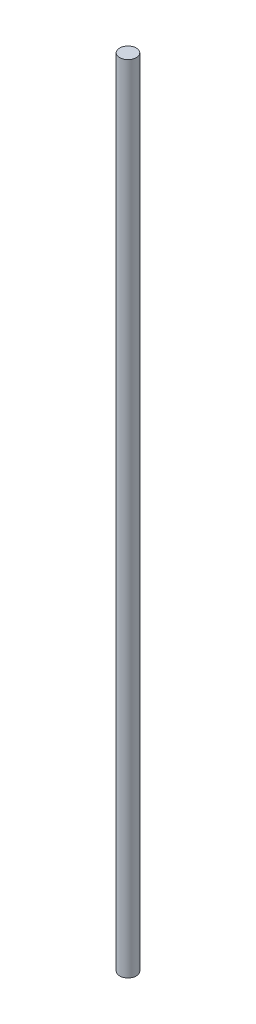
ISO-10303-21;
HEADER;
FILE_DESCRIPTION(('STEP AP214'),'2;1');
FILE_NAME('part.step','',(''),(''),'','','');
FILE_SCHEMA(('AUTOMOTIVE_DESIGN { 1 0 10303 214 1 1 1 1 }'));
ENDSEC;
DATA;
#1=APPLICATION_CONTEXT('core data for automotive mechanical design processes');
#2=APPLICATION_PROTOCOL_DEFINITION('international standard','automotive_design',2000,#1);
#3=PRODUCT_CONTEXT('',#1,'mechanical');
#4=PRODUCT('Part','Part','',(#3));
#5=PRODUCT_RELATED_PRODUCT_CATEGORY('part','',(#4));
#6=PRODUCT_DEFINITION_FORMATION('','',#4);
#7=PRODUCT_DEFINITION_CONTEXT('part definition',#1,'design');
#8=PRODUCT_DEFINITION('design','',#6,#7);
#9=PRODUCT_DEFINITION_SHAPE('','',#8);
#10=(LENGTH_UNIT() NAMED_UNIT(*) SI_UNIT(.MILLI.,.METRE.));
#11=(NAMED_UNIT(*) PLANE_ANGLE_UNIT() SI_UNIT($,.RADIAN.));
#12=(NAMED_UNIT(*) SI_UNIT($,.STERADIAN.) SOLID_ANGLE_UNIT());
#13=UNCERTAINTY_MEASURE_WITH_UNIT(LENGTH_MEASURE(1.E-05),#10,'distance_accuracy_value','');
#14=(GEOMETRIC_REPRESENTATION_CONTEXT(3) GLOBAL_UNCERTAINTY_ASSIGNED_CONTEXT((#13)) GLOBAL_UNIT_ASSIGNED_CONTEXT((#10,
#11,#12)) REPRESENTATION_CONTEXT('',''));
#15=CARTESIAN_POINT('',(0.,0.,0.));
#16=DIRECTION('',(0.,0.,1.));
#17=DIRECTION('',(1.,0.,0.));
#18=AXIS2_PLACEMENT_3D('',#15,#16,#17);
#19=CARTESIAN_POINT('',(0.,477.,0.));
#20=DIRECTION('',(0.,-1.,0.));
#21=DIRECTION('',(0.,0.,-1.));
#22=AXIS2_PLACEMENT_3D('',#19,#20,#21);
#23=CYLINDRICAL_SURFACE('',#22,5.);
#24=CARTESIAN_POINT('',(0.,477.,0.));
#25=DIRECTION('',(0.,1.,0.));
#26=DIRECTION('',(0.,0.,1.));
#27=AXIS2_PLACEMENT_3D('',#24,#25,#26);
#28=CIRCLE('',#27,5.);
#29=CARTESIAN_POINT('',(0.,477.,5.));
#30=VERTEX_POINT('',#29);
#31=EDGE_CURVE('E10',#30,#30,#28,.T.);
#32=ORIENTED_EDGE('',*,*,#31,.F.);
#33=EDGE_LOOP('',(#32));
#34=FACE_BOUND('',#33,.T.);
#35=CARTESIAN_POINT('',(0.,0.,0.));
#36=DIRECTION('',(0.,1.,0.));
#37=DIRECTION('',(0.,0.,1.));
#38=AXIS2_PLACEMENT_3D('',#35,#36,#37);
#39=CIRCLE('',#38,5.);
#40=CARTESIAN_POINT('',(0.,0.,5.));
#41=VERTEX_POINT('',#40);
#42=EDGE_CURVE('E34',#41,#41,#39,.T.);
#43=ORIENTED_EDGE('',*,*,#42,.T.);
#44=EDGE_LOOP('',(#43));
#45=FACE_BOUND('',#44,.T.);
#46=ADVANCED_FACE('F31',(#34,#45),#23,.T.);
#47=CARTESIAN_POINT('',(0.,477.,0.));
#48=DIRECTION('',(0.,1.,0.));
#49=DIRECTION('',(0.,0.,1.));
#50=AXIS2_PLACEMENT_3D('',#47,#48,#49);
#51=PLANE('',#50);
#52=ORIENTED_EDGE('',*,*,#31,.T.);
#53=EDGE_LOOP('',(#52));
#54=FACE_BOUND('',#53,.T.);
#55=ADVANCED_FACE('F46',(#54),#51,.T.);
#56=CARTESIAN_POINT('',(0.,0.,0.));
#57=DIRECTION('',(0.,1.,0.));
#58=DIRECTION('',(0.,0.,1.));
#59=AXIS2_PLACEMENT_3D('',#56,#57,#58);
#60=PLANE('',#59);
#61=ORIENTED_EDGE('',*,*,#42,.F.);
#62=EDGE_LOOP('',(#61));
#63=FACE_BOUND('',#62,.T.);
#64=ADVANCED_FACE('F44',(#63),#60,.F.);
#65=CLOSED_SHELL('',(#46,#55,#64));
#66=MANIFOLD_SOLID_BREP('B2',#65);
#67=ADVANCED_BREP_SHAPE_REPRESENTATION('',(#18,#66),#14);
#68=SHAPE_DEFINITION_REPRESENTATION(#9,#67);
ENDSEC;
END-ISO-10303-21;
